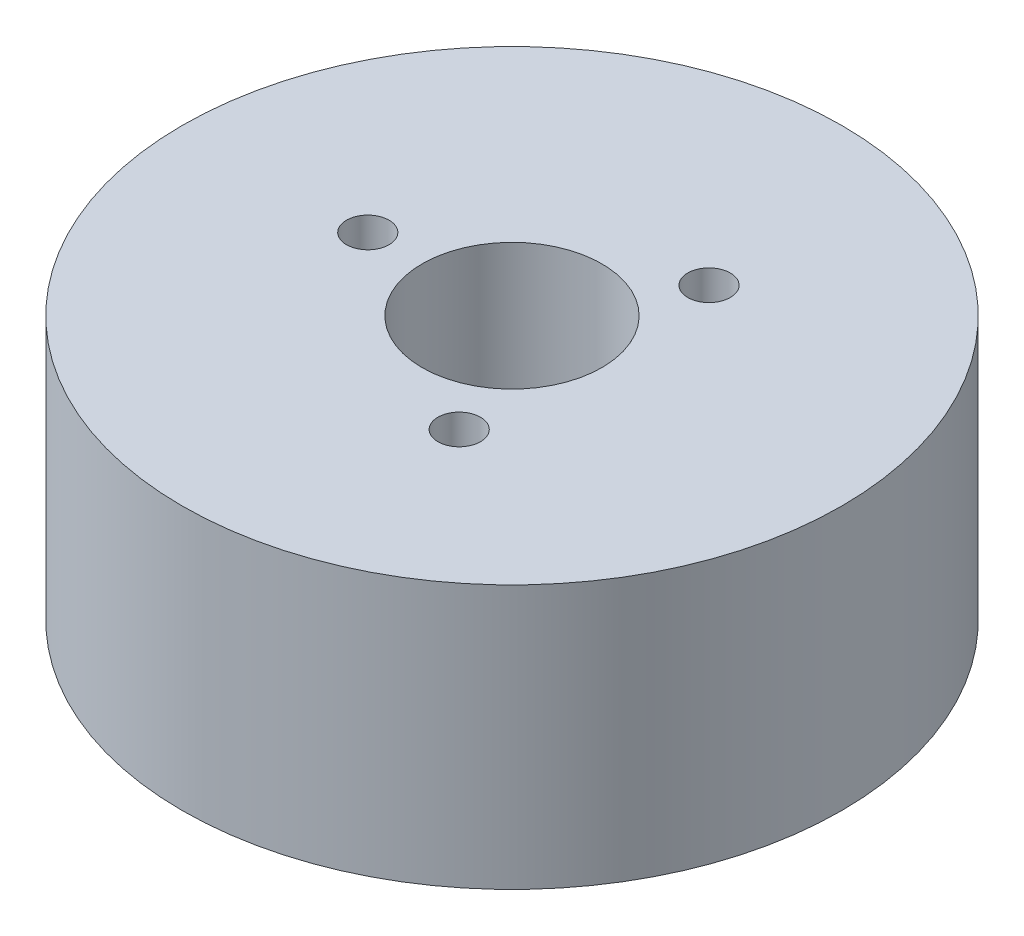
ISO-10303-21;
HEADER;
FILE_DESCRIPTION(('STEP AP214'),'2;1');
FILE_NAME('part.step','',(''),(''),'','','');
FILE_SCHEMA(('AUTOMOTIVE_DESIGN { 1 0 10303 214 1 1 1 1 }'));
ENDSEC;
DATA;
#1=APPLICATION_CONTEXT('core data for automotive mechanical design processes');
#2=APPLICATION_PROTOCOL_DEFINITION('international standard','automotive_design',2000,#1);
#3=PRODUCT_CONTEXT('',#1,'mechanical');
#4=PRODUCT('Part','Part','',(#3));
#5=PRODUCT_RELATED_PRODUCT_CATEGORY('part','',(#4));
#6=PRODUCT_DEFINITION_FORMATION('','',#4);
#7=PRODUCT_DEFINITION_CONTEXT('part definition',#1,'design');
#8=PRODUCT_DEFINITION('design','',#6,#7);
#9=PRODUCT_DEFINITION_SHAPE('','',#8);
#10=(LENGTH_UNIT() NAMED_UNIT(*) SI_UNIT(.MILLI.,.METRE.));
#11=(NAMED_UNIT(*) PLANE_ANGLE_UNIT() SI_UNIT($,.RADIAN.));
#12=(NAMED_UNIT(*) SI_UNIT($,.STERADIAN.) SOLID_ANGLE_UNIT());
#13=UNCERTAINTY_MEASURE_WITH_UNIT(LENGTH_MEASURE(1.E-05),#10,'distance_accuracy_value','');
#14=(GEOMETRIC_REPRESENTATION_CONTEXT(3) GLOBAL_UNCERTAINTY_ASSIGNED_CONTEXT((#13)) GLOBAL_UNIT_ASSIGNED_CONTEXT((#10,
#11,#12)) REPRESENTATION_CONTEXT('',''));
#15=CARTESIAN_POINT('',(0.,0.,0.));
#16=DIRECTION('',(0.,0.,1.));
#17=DIRECTION('',(1.,0.,0.));
#18=AXIS2_PLACEMENT_3D('',#15,#16,#17);
#19=CARTESIAN_POINT('',(0.,22.,0.));
#20=DIRECTION('',(0.,-1.,0.));
#21=DIRECTION('',(0.,0.,-1.));
#22=AXIS2_PLACEMENT_3D('',#19,#20,#21);
#23=CYLINDRICAL_SURFACE('',#22,27.5);
#24=CARTESIAN_POINT('',(0.,22.,0.));
#25=DIRECTION('',(0.,1.,0.));
#26=DIRECTION('',(0.,0.,1.));
#27=AXIS2_PLACEMENT_3D('',#24,#25,#26);
#28=CIRCLE('',#27,27.5);
#29=CARTESIAN_POINT('',(0.,22.,27.5));
#30=VERTEX_POINT('',#29);
#31=EDGE_CURVE('E10',#30,#30,#28,.T.);
#32=ORIENTED_EDGE('',*,*,#31,.F.);
#33=EDGE_LOOP('',(#32));
#34=FACE_BOUND('',#33,.T.);
#35=CARTESIAN_POINT('',(0.,0.,0.));
#36=DIRECTION('',(0.,1.,0.));
#37=DIRECTION('',(0.,0.,1.));
#38=AXIS2_PLACEMENT_3D('',#35,#36,#37);
#39=CIRCLE('',#38,27.5);
#40=CARTESIAN_POINT('',(0.,0.,27.5));
#41=VERTEX_POINT('',#40);
#42=EDGE_CURVE('E37',#41,#41,#39,.T.);
#43=ORIENTED_EDGE('',*,*,#42,.T.);
#44=EDGE_LOOP('',(#43));
#45=FACE_BOUND('',#44,.T.);
#46=ADVANCED_FACE('F40',(#34,#45),#23,.T.);
#47=CARTESIAN_POINT('',(0.,22.,0.));
#48=DIRECTION('',(0.,1.,0.));
#49=DIRECTION('',(0.,0.,1.));
#50=AXIS2_PLACEMENT_3D('',#47,#48,#49);
#51=PLANE('',#50);
#52=CARTESIAN_POINT('',(6.01448772835519,22.,10.4173983270106));
#53=DIRECTION('',(0.,1.,0.));
#54=DIRECTION('',(0.866025403784436,0.,-0.500000000000004));
#55=AXIS2_PLACEMENT_3D('',#52,#53,#54);
#56=CIRCLE('',#55,1.77534397598695);
#57=CARTESIAN_POINT('',(7.55198071201555,22.,9.5297263390171));
#58=VERTEX_POINT('',#57);
#59=EDGE_CURVE('E70',#58,#58,#56,.T.);
#60=ORIENTED_EDGE('',*,*,#59,.F.);
#61=EDGE_LOOP('',(#60));
#62=FACE_BOUND('',#61,.T.);
#63=CARTESIAN_POINT('',(6.01448772835504,22.,-10.4173983270107));
#64=DIRECTION('',(0.,1.,0.));
#65=DIRECTION('',(-0.866025403784443,0.,-0.499999999999992));
#66=AXIS2_PLACEMENT_3D('',#63,#64,#65);
#67=CIRCLE('',#66,1.77534397598695);
#68=CARTESIAN_POINT('',(4.47699474469466,22.,-11.3050703150041));
#69=VERTEX_POINT('',#68);
#70=EDGE_CURVE('E61',#69,#69,#67,.T.);
#71=ORIENTED_EDGE('',*,*,#70,.F.);
#72=EDGE_LOOP('',(#71));
#73=FACE_BOUND('',#72,.T.);
#74=CARTESIAN_POINT('',(-12.0289754567103,22.,0.));
#75=DIRECTION('',(0.,1.,0.));
#76=DIRECTION('',(0.,0.,1.));
#77=AXIS2_PLACEMENT_3D('',#74,#75,#76);
#78=CIRCLE('',#77,1.77534397598695);
#79=CARTESIAN_POINT('',(-12.0289754567103,22.,1.77534397598695));
#80=VERTEX_POINT('',#79);
#81=EDGE_CURVE('E54',#80,#80,#78,.T.);
#82=ORIENTED_EDGE('',*,*,#81,.F.);
#83=EDGE_LOOP('',(#82));
#84=FACE_BOUND('',#83,.T.);
#85=CARTESIAN_POINT('',(0.,22.,0.));
#86=DIRECTION('',(0.,1.,0.));
#87=DIRECTION('',(0.,0.,1.));
#88=AXIS2_PLACEMENT_3D('',#85,#86,#87);
#89=CIRCLE('',#88,7.5);
#90=CARTESIAN_POINT('',(0.,22.,7.5));
#91=VERTEX_POINT('',#90);
#92=EDGE_CURVE('E50',#91,#91,#89,.T.);
#93=ORIENTED_EDGE('',*,*,#92,.F.);
#94=EDGE_LOOP('',(#93));
#95=FACE_BOUND('',#94,.T.);
#96=ORIENTED_EDGE('',*,*,#31,.T.);
#97=EDGE_LOOP('',(#96));
#98=FACE_BOUND('',#97,.T.);
#99=ADVANCED_FACE('F85',(#62,#73,#84,#95,#98),#51,.T.);
#100=CARTESIAN_POINT('',(0.,0.,0.));
#101=DIRECTION('',(0.,1.,0.));
#102=DIRECTION('',(0.,0.,1.));
#103=AXIS2_PLACEMENT_3D('',#100,#101,#102);
#104=PLANE('',#103);
#105=CARTESIAN_POINT('',(0.,0.,0.));
#106=DIRECTION('',(0.,1.,0.));
#107=DIRECTION('',(0.,0.,1.));
#108=AXIS2_PLACEMENT_3D('',#105,#106,#107);
#109=CIRCLE('',#108,7.5);
#110=CARTESIAN_POINT('',(0.,0.,7.5));
#111=VERTEX_POINT('',#110);
#112=EDGE_CURVE('E47',#111,#111,#109,.T.);
#113=ORIENTED_EDGE('',*,*,#112,.T.);
#114=EDGE_LOOP('',(#113));
#115=FACE_BOUND('',#114,.T.);
#116=ORIENTED_EDGE('',*,*,#42,.F.);
#117=EDGE_LOOP('',(#116));
#118=FACE_BOUND('',#117,.T.);
#119=ADVANCED_FACE('F84',(#115,#118),#104,.F.);
#120=CARTESIAN_POINT('',(0.,22.,0.));
#121=DIRECTION('',(0.,-1.,0.));
#122=DIRECTION('',(0.,0.,-1.));
#123=AXIS2_PLACEMENT_3D('',#120,#121,#122);
#124=CYLINDRICAL_SURFACE('',#123,7.5);
#125=ORIENTED_EDGE('',*,*,#92,.T.);
#126=EDGE_LOOP('',(#125));
#127=FACE_BOUND('',#126,.T.);
#128=ORIENTED_EDGE('',*,*,#112,.F.);
#129=EDGE_LOOP('',(#128));
#130=FACE_BOUND('',#129,.T.);
#131=ADVANCED_FACE('F91',(#127,#130),#124,.F.);
#132=CARTESIAN_POINT('',(-12.0289754567103,1.61264710819028,0.));
#133=DIRECTION('',(0.,1.,0.));
#134=DIRECTION('',(0.,0.,1.));
#135=AXIS2_PLACEMENT_3D('',#132,#133,#134);
#136=CYLINDRICAL_SURFACE('',#135,1.77534397598695);
#137=CARTESIAN_POINT('',(-12.0289754567103,1.61264710819028,0.));
#138=DIRECTION('',(0.,1.,0.));
#139=DIRECTION('',(0.,0.,1.));
#140=AXIS2_PLACEMENT_3D('',#137,#138,#139);
#141=CIRCLE('',#140,1.77534397598695);
#142=CARTESIAN_POINT('',(-12.0289754567103,1.61264710819028,1.77534397598695));
#143=VERTEX_POINT('',#142);
#144=EDGE_CURVE('E55',#143,#143,#141,.T.);
#145=ORIENTED_EDGE('',*,*,#144,.F.);
#146=EDGE_LOOP('',(#145));
#147=FACE_BOUND('',#146,.T.);
#148=ORIENTED_EDGE('',*,*,#81,.T.);
#149=EDGE_LOOP('',(#148));
#150=FACE_BOUND('',#149,.T.);
#151=ADVANCED_FACE('F96',(#147,#150),#136,.F.);
#152=CARTESIAN_POINT('',(-12.0289754567103,1.61264710819028,0.));
#153=DIRECTION('',(0.,1.,0.));
#154=DIRECTION('',(0.,0.,1.));
#155=AXIS2_PLACEMENT_3D('',#152,#153,#154);
#156=PLANE('',#155);
#157=ORIENTED_EDGE('',*,*,#144,.T.);
#158=EDGE_LOOP('',(#157));
#159=FACE_BOUND('',#158,.T.);
#160=ADVANCED_FACE('F127',(#159),#156,.T.);
#161=CARTESIAN_POINT('',(6.01448772835504,1.61264710819028,-10.4173983270107));
#162=DIRECTION('',(0.,1.,0.));
#163=DIRECTION('',(0.,0.,1.));
#164=AXIS2_PLACEMENT_3D('',#161,#162,#163);
#165=CYLINDRICAL_SURFACE('',#164,1.77534397598695);
#166=CARTESIAN_POINT('',(6.01448772835504,1.61264710819028,-10.4173983270107));
#167=DIRECTION('',(0.,1.,0.));
#168=DIRECTION('',(-0.866025403784443,0.,-0.499999999999992));
#169=AXIS2_PLACEMENT_3D('',#166,#167,#168);
#170=CIRCLE('',#169,1.77534397598695);
#171=CARTESIAN_POINT('',(4.47699474469466,1.61264710819028,-11.3050703150041));
#172=VERTEX_POINT('',#171);
#173=EDGE_CURVE('E63',#172,#172,#170,.T.);
#174=ORIENTED_EDGE('',*,*,#173,.F.);
#175=EDGE_LOOP('',(#174));
#176=FACE_BOUND('',#175,.T.);
#177=ORIENTED_EDGE('',*,*,#70,.T.);
#178=EDGE_LOOP('',(#177));
#179=FACE_BOUND('',#178,.T.);
#180=ADVANCED_FACE('F133',(#176,#179),#165,.F.);
#181=CARTESIAN_POINT('',(6.01448772835504,1.61264710819028,-10.4173983270107));
#182=DIRECTION('',(0.,1.,0.));
#183=DIRECTION('',(-0.866025403784443,0.,-0.499999999999992));
#184=AXIS2_PLACEMENT_3D('',#181,#182,#183);
#185=PLANE('',#184);
#186=ORIENTED_EDGE('',*,*,#173,.T.);
#187=EDGE_LOOP('',(#186));
#188=FACE_BOUND('',#187,.T.);
#189=ADVANCED_FACE('F77',(#188),#185,.T.);
#190=CARTESIAN_POINT('',(6.01448772835519,1.61264710819028,10.4173983270106));
#191=DIRECTION('',(0.,1.,0.));
#192=DIRECTION('',(0.,0.,1.));
#193=AXIS2_PLACEMENT_3D('',#190,#191,#192);
#194=CYLINDRICAL_SURFACE('',#193,1.77534397598695);
#195=CARTESIAN_POINT('',(6.01448772835519,1.61264710819028,10.4173983270106));
#196=DIRECTION('',(0.,1.,0.));
#197=DIRECTION('',(0.866025403784436,0.,-0.500000000000004));
#198=AXIS2_PLACEMENT_3D('',#195,#196,#197);
#199=CIRCLE('',#198,1.77534397598695);
#200=CARTESIAN_POINT('',(7.55198071201555,1.61264710819028,9.5297263390171));
#201=VERTEX_POINT('',#200);
#202=EDGE_CURVE('E59',#201,#201,#199,.T.);
#203=ORIENTED_EDGE('',*,*,#202,.F.);
#204=EDGE_LOOP('',(#203));
#205=FACE_BOUND('',#204,.T.);
#206=ORIENTED_EDGE('',*,*,#59,.T.);
#207=EDGE_LOOP('',(#206));
#208=FACE_BOUND('',#207,.T.);
#209=ADVANCED_FACE('F73',(#205,#208),#194,.F.);
#210=CARTESIAN_POINT('',(6.01448772835519,1.61264710819028,10.4173983270106));
#211=DIRECTION('',(0.,1.,0.));
#212=DIRECTION('',(0.866025403784436,0.,-0.500000000000004));
#213=AXIS2_PLACEMENT_3D('',#210,#211,#212);
#214=PLANE('',#213);
#215=ORIENTED_EDGE('',*,*,#202,.T.);
#216=EDGE_LOOP('',(#215));
#217=FACE_BOUND('',#216,.T.);
#218=ADVANCED_FACE('F71',(#217),#214,.T.);
#219=CLOSED_SHELL('',(#46,#99,#119,#131,#151,#160,#180,#189,#209,#218));
#220=MANIFOLD_SOLID_BREP('B2',#219);
#221=ADVANCED_BREP_SHAPE_REPRESENTATION('',(#18,#220),#14);
#222=SHAPE_DEFINITION_REPRESENTATION(#9,#221);
ENDSEC;
END-ISO-10303-21;
